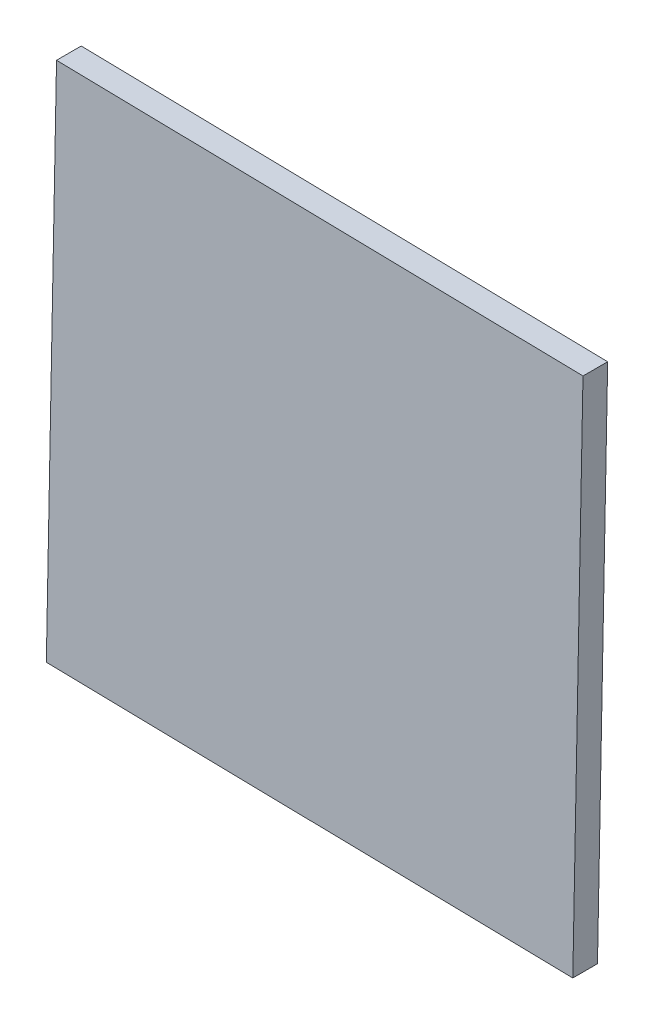
ISO-10303-21;
HEADER;
FILE_DESCRIPTION(('STEP AP214'),'2;1');
FILE_NAME('part.step','',(''),(''),'','','');
FILE_SCHEMA(('AUTOMOTIVE_DESIGN { 1 0 10303 214 1 1 1 1 }'));
ENDSEC;
DATA;
#1=APPLICATION_CONTEXT('core data for automotive mechanical design processes');
#2=APPLICATION_PROTOCOL_DEFINITION('international standard','automotive_design',2000,#1);
#3=PRODUCT_CONTEXT('',#1,'mechanical');
#4=PRODUCT('Part','Part','',(#3));
#5=PRODUCT_RELATED_PRODUCT_CATEGORY('part','',(#4));
#6=PRODUCT_DEFINITION_FORMATION('','',#4);
#7=PRODUCT_DEFINITION_CONTEXT('part definition',#1,'design');
#8=PRODUCT_DEFINITION('design','',#6,#7);
#9=PRODUCT_DEFINITION_SHAPE('','',#8);
#10=(LENGTH_UNIT() NAMED_UNIT(*) SI_UNIT(.MILLI.,.METRE.));
#11=(NAMED_UNIT(*) PLANE_ANGLE_UNIT() SI_UNIT($,.RADIAN.));
#12=(NAMED_UNIT(*) SI_UNIT($,.STERADIAN.) SOLID_ANGLE_UNIT());
#13=UNCERTAINTY_MEASURE_WITH_UNIT(LENGTH_MEASURE(1.E-05),#10,'distance_accuracy_value','');
#14=(GEOMETRIC_REPRESENTATION_CONTEXT(3) GLOBAL_UNCERTAINTY_ASSIGNED_CONTEXT((#13)) GLOBAL_UNIT_ASSIGNED_CONTEXT((#10,
#11,#12)) REPRESENTATION_CONTEXT('',''));
#15=CARTESIAN_POINT('',(0.,0.,0.));
#16=DIRECTION('',(0.,0.,1.));
#17=DIRECTION('',(1.,0.,0.));
#18=AXIS2_PLACEMENT_3D('',#15,#16,#17);
#19=CARTESIAN_POINT('',(-1.66355339164993,3.30225427634785,43.6520965279299));
#20=DIRECTION('',(0.,0.,-1.));
#21=DIRECTION('',(-0.999812677663925,0.0193548335692301,0.));
#22=AXIS2_PLACEMENT_3D('',#19,#20,#21);
#23=PLANE('',#22);
#24=DIRECTION('',(-0.999812677663925,0.0193548335692301,0.));
#25=VECTOR('',#24,1.);
#26=CARTESIAN_POINT('',(6.30560796515175,-4.98153925495523,43.6520965279302));
#27=LINE('',#26,#25);
#28=CARTESIAN_POINT('',(6.30560796515175,-4.98153925495523,43.6520965279302));
#29=VERTEX_POINT('',#28);
#30=CARTESIAN_POINT('',(-9.94734692295302,-4.66690708045383,43.6520965279297));
#31=VERTEX_POINT('',#30);
#32=EDGE_CURVE('E73',#29,#31,#27,.T.);
#33=ORIENTED_EDGE('',*,*,#32,.T.);
#34=DIRECTION('',(0.0193548335692301,0.999812677663925,0.));
#35=VECTOR('',#34,1.);
#36=CARTESIAN_POINT('',(-9.94734692295302,-4.66690708045383,43.6520965279297));
#37=LINE('',#36,#35);
#38=CARTESIAN_POINT('',(-9.63271474845161,11.5860478076509,43.6520965279295));
#39=VERTEX_POINT('',#38);
#40=EDGE_CURVE('E35',#31,#39,#37,.T.);
#41=ORIENTED_EDGE('',*,*,#40,.T.);
#42=DIRECTION('',(0.999812677663925,-0.0193548335692301,0.));
#43=VECTOR('',#42,1.);
#44=CARTESIAN_POINT('',(6.62024013965315,11.2714156331495,43.65209652793));
#45=LINE('',#44,#43);
#46=CARTESIAN_POINT('',(6.62024013965315,11.2714156331495,43.65209652793));
#47=VERTEX_POINT('',#46);
#48=EDGE_CURVE('E70',#39,#47,#45,.T.);
#49=ORIENTED_EDGE('',*,*,#48,.T.);
#50=DIRECTION('',(-0.0193548335692301,-0.999812677663925,0.));
#51=VECTOR('',#50,1.);
#52=CARTESIAN_POINT('',(6.30560796515175,-4.98153925495523,43.6520965279302));
#53=LINE('',#52,#51);
#54=EDGE_CURVE('E91',#47,#29,#53,.T.);
#55=ORIENTED_EDGE('',*,*,#54,.T.);
#56=EDGE_LOOP('',(#33,#41,#49,#55));
#57=FACE_BOUND('',#56,.T.);
#58=ADVANCED_FACE('F32',(#57),#23,.T.);
#59=CARTESIAN_POINT('',(-9.94734692295304,-4.66690708045382,44.4140965279297));
#60=DIRECTION('',(0.999812677663925,-0.0193548335692301,0.));
#61=DIRECTION('',(0.0193548335692301,0.999812677663925,0.));
#62=AXIS2_PLACEMENT_3D('',#59,#60,#61);
#63=PLANE('',#62);
#64=DIRECTION('',(0.,0.,1.));
#65=VECTOR('',#64,1.);
#66=CARTESIAN_POINT('',(-9.63271474845164,11.5860478076509,44.4140965279295));
#67=LINE('',#66,#65);
#68=CARTESIAN_POINT('',(-9.63271474845164,11.5860478076509,44.4140965279295));
#69=VERTEX_POINT('',#68);
#70=EDGE_CURVE('E78',#69,#39,#67,.F.);
#71=ORIENTED_EDGE('',*,*,#70,.T.);
#72=ORIENTED_EDGE('',*,*,#40,.F.);
#73=DIRECTION('',(0.,0.,1.));
#74=VECTOR('',#73,1.);
#75=CARTESIAN_POINT('',(-9.94734692295304,-4.66690708045382,44.4140965279297));
#76=LINE('',#75,#74);
#77=CARTESIAN_POINT('',(-9.94734692295304,-4.66690708045382,44.4140965279297));
#78=VERTEX_POINT('',#77);
#79=EDGE_CURVE('E95',#31,#78,#76,.T.);
#80=ORIENTED_EDGE('',*,*,#79,.T.);
#81=DIRECTION('',(0.0193548335692301,0.999812677663925,0.));
#82=VECTOR('',#81,1.);
#83=CARTESIAN_POINT('',(-9.79003083570234,3.45957036359857,44.4140965279295));
#84=LINE('',#83,#82);
#85=EDGE_CURVE('E88',#78,#69,#84,.T.);
#86=ORIENTED_EDGE('',*,*,#85,.T.);
#87=EDGE_LOOP('',(#71,#72,#80,#86));
#88=FACE_BOUND('',#87,.T.);
#89=ADVANCED_FACE('F87',(#88),#63,.F.);
#90=CARTESIAN_POINT('',(6.62024013965313,11.2714156331495,44.41409652793));
#91=DIRECTION('',(-0.0193548335692301,-0.999812677663925,0.));
#92=DIRECTION('',(0.999812677663925,-0.0193548335692301,0.));
#93=AXIS2_PLACEMENT_3D('',#90,#91,#92);
#94=PLANE('',#93);
#95=DIRECTION('',(0.,0.,1.));
#96=VECTOR('',#95,1.);
#97=CARTESIAN_POINT('',(6.62024013965313,11.2714156331495,44.41409652793));
#98=LINE('',#97,#96);
#99=CARTESIAN_POINT('',(6.62024013965313,11.2714156331495,44.41409652793));
#100=VERTEX_POINT('',#99);
#101=EDGE_CURVE('E84',#100,#47,#98,.F.);
#102=ORIENTED_EDGE('',*,*,#101,.T.);
#103=ORIENTED_EDGE('',*,*,#48,.F.);
#104=ORIENTED_EDGE('',*,*,#70,.F.);
#105=DIRECTION('',(-0.999812677663925,0.0193548335692301,0.));
#106=VECTOR('',#105,1.);
#107=CARTESIAN_POINT('',(-1.50623730439925,11.4287317204002,44.4140965279297));
#108=LINE('',#107,#106);
#109=EDGE_CURVE('E98',#69,#100,#108,.F.);
#110=ORIENTED_EDGE('',*,*,#109,.T.);
#111=EDGE_LOOP('',(#102,#103,#104,#110));
#112=FACE_BOUND('',#111,.T.);
#113=ADVANCED_FACE('F81',(#112),#94,.F.);
#114=CARTESIAN_POINT('',(6.30560796515172,-4.98153925495522,44.4140965279302));
#115=DIRECTION('',(-0.999812677663925,0.0193548335692301,0.));
#116=DIRECTION('',(-0.0193548335692301,-0.999812677663925,0.));
#117=AXIS2_PLACEMENT_3D('',#114,#115,#116);
#118=PLANE('',#117);
#119=DIRECTION('',(0.,0.,1.));
#120=VECTOR('',#119,1.);
#121=CARTESIAN_POINT('',(6.30560796515172,-4.98153925495522,44.4140965279302));
#122=LINE('',#121,#120);
#123=CARTESIAN_POINT('',(6.30560796515172,-4.98153925495522,44.4140965279302));
#124=VERTEX_POINT('',#123);
#125=EDGE_CURVE('E49',#124,#29,#122,.F.);
#126=ORIENTED_EDGE('',*,*,#125,.T.);
#127=ORIENTED_EDGE('',*,*,#54,.F.);
#128=ORIENTED_EDGE('',*,*,#101,.F.);
#129=DIRECTION('',(0.0193548335692301,0.999812677663925,0.));
#130=VECTOR('',#129,1.);
#131=CARTESIAN_POINT('',(6.46292405240242,3.14493818909716,44.4140965279301));
#132=LINE('',#131,#130);
#133=EDGE_CURVE('E41',#100,#124,#132,.F.);
#134=ORIENTED_EDGE('',*,*,#133,.T.);
#135=EDGE_LOOP('',(#126,#127,#128,#134));
#136=FACE_BOUND('',#135,.T.);
#137=ADVANCED_FACE('F103',(#136),#118,.F.);
#138=CARTESIAN_POINT('',(6.30560796515172,-4.98153925495522,44.4140965279302));
#139=DIRECTION('',(0.0193548335692301,0.999812677663925,0.));
#140=DIRECTION('',(-0.999812677663925,0.0193548335692301,0.));
#141=AXIS2_PLACEMENT_3D('',#138,#139,#140);
#142=PLANE('',#141);
#143=ORIENTED_EDGE('',*,*,#79,.F.);
#144=ORIENTED_EDGE('',*,*,#32,.F.);
#145=ORIENTED_EDGE('',*,*,#125,.F.);
#146=DIRECTION('',(-0.999812677663925,0.0193548335692301,0.));
#147=VECTOR('',#146,1.);
#148=CARTESIAN_POINT('',(-1.82086947890066,-4.82422316770452,44.4140965279299));
#149=LINE('',#148,#147);
#150=EDGE_CURVE('E11',#124,#78,#149,.T.);
#151=ORIENTED_EDGE('',*,*,#150,.T.);
#152=EDGE_LOOP('',(#143,#144,#145,#151));
#153=FACE_BOUND('',#152,.T.);
#154=ADVANCED_FACE('F106',(#153),#142,.F.);
#155=CARTESIAN_POINT('',(-1.66355339164995,3.30225427634787,44.4140965279298));
#156=DIRECTION('',(0.,0.,-1.));
#157=DIRECTION('',(-0.999812677663925,0.0193548335692301,0.));
#158=AXIS2_PLACEMENT_3D('',#155,#156,#157);
#159=PLANE('',#158);
#160=ORIENTED_EDGE('',*,*,#133,.F.);
#161=ORIENTED_EDGE('',*,*,#109,.F.);
#162=ORIENTED_EDGE('',*,*,#85,.F.);
#163=ORIENTED_EDGE('',*,*,#150,.F.);
#164=EDGE_LOOP('',(#160,#161,#162,#163));
#165=FACE_BOUND('',#164,.T.);
#166=ADVANCED_FACE('F105',(#165),#159,.F.);
#167=CLOSED_SHELL('',(#58,#89,#113,#137,#154,#166));
#168=MANIFOLD_SOLID_BREP('B2',#167);
#169=ADVANCED_BREP_SHAPE_REPRESENTATION('',(#18,#168),#14);
#170=SHAPE_DEFINITION_REPRESENTATION(#9,#169);
ENDSEC;
END-ISO-10303-21;
